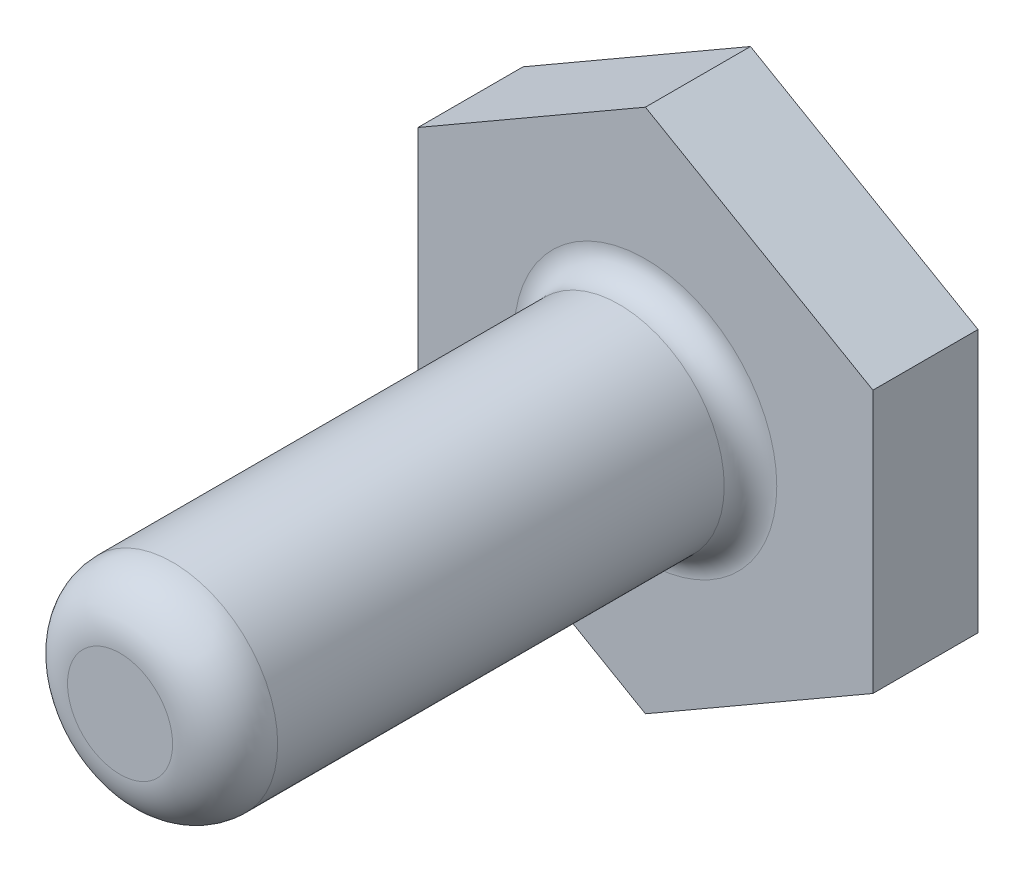
ISO-10303-21;
HEADER;
FILE_DESCRIPTION(('STEP AP214'),'2;1');
FILE_NAME('part.step','',(''),(''),'','','');
FILE_SCHEMA(('AUTOMOTIVE_DESIGN { 1 0 10303 214 1 1 1 1 }'));
ENDSEC;
DATA;
#1=APPLICATION_CONTEXT('core data for automotive mechanical design processes');
#2=APPLICATION_PROTOCOL_DEFINITION('international standard','automotive_design',2000,#1);
#3=PRODUCT_CONTEXT('',#1,'mechanical');
#4=PRODUCT('Part','Part','',(#3));
#5=PRODUCT_RELATED_PRODUCT_CATEGORY('part','',(#4));
#6=PRODUCT_DEFINITION_FORMATION('','',#4);
#7=PRODUCT_DEFINITION_CONTEXT('part definition',#1,'design');
#8=PRODUCT_DEFINITION('design','',#6,#7);
#9=PRODUCT_DEFINITION_SHAPE('','',#8);
#10=(LENGTH_UNIT() NAMED_UNIT(*) SI_UNIT(.MILLI.,.METRE.));
#11=(NAMED_UNIT(*) PLANE_ANGLE_UNIT() SI_UNIT($,.RADIAN.));
#12=(NAMED_UNIT(*) SI_UNIT($,.STERADIAN.) SOLID_ANGLE_UNIT());
#13=UNCERTAINTY_MEASURE_WITH_UNIT(LENGTH_MEASURE(1.E-05),#10,'distance_accuracy_value','');
#14=(GEOMETRIC_REPRESENTATION_CONTEXT(3) GLOBAL_UNCERTAINTY_ASSIGNED_CONTEXT((#13)) GLOBAL_UNIT_ASSIGNED_CONTEXT((#10,
#11,#12)) REPRESENTATION_CONTEXT('',''));
#15=CARTESIAN_POINT('',(0.,0.,0.));
#16=DIRECTION('',(0.,0.,1.));
#17=DIRECTION('',(1.,0.,0.));
#18=AXIS2_PLACEMENT_3D('',#15,#16,#17);
#19=CARTESIAN_POINT('',(-0.353108987948059,13.1896737599082,4.));
#20=DIRECTION('',(-0.499999999999999,-0.866025403784439,0.));
#21=DIRECTION('',(0.866025403784439,-0.5,0.));
#22=AXIS2_PLACEMENT_3D('',#19,#20,#21);
#23=PLANE('',#22);
#24=DIRECTION('',(-0.866025403784439,0.499999999999999,0.));
#25=VECTOR('',#24,1.);
#26=CARTESIAN_POINT('',(-0.353108987948059,13.1896737599082,0.));
#27=LINE('',#26,#25);
#28=CARTESIAN_POINT('',(-0.353108987948059,13.1896737599082,0.));
#29=VERTEX_POINT('',#28);
#30=CARTESIAN_POINT('',(-9.01336302579243,18.1896737599082,0.));
#31=VERTEX_POINT('',#30);
#32=EDGE_CURVE('E119',#29,#31,#27,.T.);
#33=ORIENTED_EDGE('',*,*,#32,.T.);
#34=DIRECTION('',(0.,0.,-1.));
#35=VECTOR('',#34,1.);
#36=CARTESIAN_POINT('',(-9.01336302579243,18.1896737599082,4.));
#37=LINE('',#36,#35);
#38=CARTESIAN_POINT('',(-9.01336302579243,18.1896737599082,4.));
#39=VERTEX_POINT('',#38);
#40=EDGE_CURVE('E136',#39,#31,#37,.T.);
#41=ORIENTED_EDGE('',*,*,#40,.F.);
#42=DIRECTION('',(-0.866025403784439,0.499999999999999,0.));
#43=VECTOR('',#42,1.);
#44=CARTESIAN_POINT('',(-0.353108987948059,13.1896737599082,4.));
#45=LINE('',#44,#43);
#46=CARTESIAN_POINT('',(-0.353108987948059,13.1896737599082,4.));
#47=VERTEX_POINT('',#46);
#48=EDGE_CURVE('E129',#47,#39,#45,.T.);
#49=ORIENTED_EDGE('',*,*,#48,.F.);
#50=DIRECTION('',(0.,0.,-1.));
#51=VECTOR('',#50,1.);
#52=CARTESIAN_POINT('',(-0.353108987948059,13.1896737599082,4.));
#53=LINE('',#52,#51);
#54=EDGE_CURVE('E115',#47,#29,#53,.T.);
#55=ORIENTED_EDGE('',*,*,#54,.T.);
#56=EDGE_LOOP('',(#33,#41,#49,#55));
#57=FACE_BOUND('',#56,.T.);
#58=ADVANCED_FACE('F33',(#57),#23,.F.);
#59=CARTESIAN_POINT('',(-9.01336302579243,18.1896737599082,4.));
#60=DIRECTION('',(0.5,-0.866025403784439,0.));
#61=DIRECTION('',(0.866025403784439,0.5,0.));
#62=AXIS2_PLACEMENT_3D('',#59,#60,#61);
#63=PLANE('',#62);
#64=DIRECTION('',(-0.866025403784439,-0.5,0.));
#65=VECTOR('',#64,1.);
#66=CARTESIAN_POINT('',(-9.01336302579243,18.1896737599082,0.));
#67=LINE('',#66,#65);
#68=CARTESIAN_POINT('',(-17.6736170636368,13.1896737599082,0.));
#69=VERTEX_POINT('',#68);
#70=EDGE_CURVE('E122',#31,#69,#67,.T.);
#71=ORIENTED_EDGE('',*,*,#70,.T.);
#72=DIRECTION('',(0.,0.,-1.));
#73=VECTOR('',#72,1.);
#74=CARTESIAN_POINT('',(-17.6736170636368,13.1896737599082,4.));
#75=LINE('',#74,#73);
#76=CARTESIAN_POINT('',(-17.6736170636368,13.1896737599082,4.));
#77=VERTEX_POINT('',#76);
#78=EDGE_CURVE('E133',#77,#69,#75,.T.);
#79=ORIENTED_EDGE('',*,*,#78,.F.);
#80=DIRECTION('',(-0.866025403784439,-0.5,0.));
#81=VECTOR('',#80,1.);
#82=CARTESIAN_POINT('',(-9.01336302579243,18.1896737599082,4.));
#83=LINE('',#82,#81);
#84=EDGE_CURVE('E88',#39,#77,#83,.T.);
#85=ORIENTED_EDGE('',*,*,#84,.F.);
#86=ORIENTED_EDGE('',*,*,#40,.T.);
#87=EDGE_LOOP('',(#71,#79,#85,#86));
#88=FACE_BOUND('',#87,.T.);
#89=ADVANCED_FACE('F159',(#88),#63,.F.);
#90=CARTESIAN_POINT('',(-17.6736170636368,13.1896737599082,4.));
#91=DIRECTION('',(1.,0.,0.));
#92=DIRECTION('',(0.,0.,-1.));
#93=AXIS2_PLACEMENT_3D('',#90,#91,#92);
#94=PLANE('',#93);
#95=DIRECTION('',(0.,-1.,0.));
#96=VECTOR('',#95,1.);
#97=CARTESIAN_POINT('',(-17.6736170636368,13.1896737599082,0.));
#98=LINE('',#97,#96);
#99=CARTESIAN_POINT('',(-17.6736170636368,3.18967375990823,0.));
#100=VERTEX_POINT('',#99);
#101=EDGE_CURVE('E124',#69,#100,#98,.T.);
#102=ORIENTED_EDGE('',*,*,#101,.T.);
#103=DIRECTION('',(0.,0.,-1.));
#104=VECTOR('',#103,1.);
#105=CARTESIAN_POINT('',(-17.6736170636368,3.18967375990823,4.));
#106=LINE('',#105,#104);
#107=CARTESIAN_POINT('',(-17.6736170636368,3.18967375990823,4.));
#108=VERTEX_POINT('',#107);
#109=EDGE_CURVE('E110',#108,#100,#106,.T.);
#110=ORIENTED_EDGE('',*,*,#109,.F.);
#111=DIRECTION('',(0.,-1.,0.));
#112=VECTOR('',#111,1.);
#113=CARTESIAN_POINT('',(-17.6736170636368,13.1896737599082,4.));
#114=LINE('',#113,#112);
#115=EDGE_CURVE('E101',#77,#108,#114,.T.);
#116=ORIENTED_EDGE('',*,*,#115,.F.);
#117=ORIENTED_EDGE('',*,*,#78,.T.);
#118=EDGE_LOOP('',(#102,#110,#116,#117));
#119=FACE_BOUND('',#118,.T.);
#120=ADVANCED_FACE('F165',(#119),#94,.F.);
#121=CARTESIAN_POINT('',(-17.6736170636368,3.18967375990823,4.));
#122=DIRECTION('',(0.5,0.866025403784439,0.));
#123=DIRECTION('',(-0.866025403784439,0.5,0.));
#124=AXIS2_PLACEMENT_3D('',#121,#122,#123);
#125=PLANE('',#124);
#126=DIRECTION('',(0.866025403784439,-0.5,0.));
#127=VECTOR('',#126,1.);
#128=CARTESIAN_POINT('',(-17.6736170636368,3.18967375990823,0.));
#129=LINE('',#128,#127);
#130=CARTESIAN_POINT('',(-9.01336302579243,-1.81032624009177,0.));
#131=VERTEX_POINT('',#130);
#132=EDGE_CURVE('E109',#100,#131,#129,.T.);
#133=ORIENTED_EDGE('',*,*,#132,.T.);
#134=DIRECTION('',(0.,0.,-1.));
#135=VECTOR('',#134,1.);
#136=CARTESIAN_POINT('',(-9.01336302579243,-1.81032624009177,4.));
#137=LINE('',#136,#135);
#138=CARTESIAN_POINT('',(-9.01336302579243,-1.81032624009177,4.));
#139=VERTEX_POINT('',#138);
#140=EDGE_CURVE('E106',#139,#131,#137,.T.);
#141=ORIENTED_EDGE('',*,*,#140,.F.);
#142=DIRECTION('',(0.866025403784439,-0.5,0.));
#143=VECTOR('',#142,1.);
#144=CARTESIAN_POINT('',(-17.6736170636368,3.18967375990823,4.));
#145=LINE('',#144,#143);
#146=EDGE_CURVE('E95',#108,#139,#145,.T.);
#147=ORIENTED_EDGE('',*,*,#146,.F.);
#148=ORIENTED_EDGE('',*,*,#109,.T.);
#149=EDGE_LOOP('',(#133,#141,#147,#148));
#150=FACE_BOUND('',#149,.T.);
#151=ADVANCED_FACE('F107',(#150),#125,.F.);
#152=CARTESIAN_POINT('',(-9.01336302579243,-1.81032624009177,4.));
#153=DIRECTION('',(-0.5,0.866025403784439,0.));
#154=DIRECTION('',(-0.866025403784439,-0.5,0.));
#155=AXIS2_PLACEMENT_3D('',#152,#153,#154);
#156=PLANE('',#155);
#157=DIRECTION('',(0.866025403784438,0.5,0.));
#158=VECTOR('',#157,1.);
#159=CARTESIAN_POINT('',(-9.01336302579243,-1.81032624009177,0.));
#160=LINE('',#159,#158);
#161=CARTESIAN_POINT('',(-0.353108987948059,3.18967375990823,0.));
#162=VERTEX_POINT('',#161);
#163=EDGE_CURVE('E73',#131,#162,#160,.T.);
#164=ORIENTED_EDGE('',*,*,#163,.T.);
#165=DIRECTION('',(0.,0.,-1.));
#166=VECTOR('',#165,1.);
#167=CARTESIAN_POINT('',(-0.353108987948059,3.18967375990823,4.));
#168=LINE('',#167,#166);
#169=CARTESIAN_POINT('',(-0.353108987948059,3.18967375990823,4.));
#170=VERTEX_POINT('',#169);
#171=EDGE_CURVE('E111',#170,#162,#168,.T.);
#172=ORIENTED_EDGE('',*,*,#171,.F.);
#173=DIRECTION('',(0.866025403784438,0.5,0.));
#174=VECTOR('',#173,1.);
#175=CARTESIAN_POINT('',(-9.01336302579243,-1.81032624009177,4.));
#176=LINE('',#175,#174);
#177=EDGE_CURVE('E99',#139,#170,#176,.T.);
#178=ORIENTED_EDGE('',*,*,#177,.F.);
#179=ORIENTED_EDGE('',*,*,#140,.T.);
#180=EDGE_LOOP('',(#164,#172,#178,#179));
#181=FACE_BOUND('',#180,.T.);
#182=ADVANCED_FACE('F113',(#181),#156,.F.);
#183=CARTESIAN_POINT('',(-0.353108987948059,3.18967375990823,4.));
#184=DIRECTION('',(-1.,0.,0.));
#185=DIRECTION('',(0.,-1.,0.));
#186=AXIS2_PLACEMENT_3D('',#183,#184,#185);
#187=PLANE('',#186);
#188=DIRECTION('',(0.,1.,0.));
#189=VECTOR('',#188,1.);
#190=CARTESIAN_POINT('',(-0.353108987948059,3.18967375990823,0.));
#191=LINE('',#190,#189);
#192=EDGE_CURVE('E79',#162,#29,#191,.T.);
#193=ORIENTED_EDGE('',*,*,#192,.T.);
#194=ORIENTED_EDGE('',*,*,#54,.F.);
#195=DIRECTION('',(0.,1.,0.));
#196=VECTOR('',#195,1.);
#197=CARTESIAN_POINT('',(-0.353108987948059,3.18967375990823,4.));
#198=LINE('',#197,#196);
#199=EDGE_CURVE('E50',#170,#47,#198,.T.);
#200=ORIENTED_EDGE('',*,*,#199,.F.);
#201=ORIENTED_EDGE('',*,*,#171,.T.);
#202=EDGE_LOOP('',(#193,#194,#200,#201));
#203=FACE_BOUND('',#202,.T.);
#204=ADVANCED_FACE('F175',(#203),#187,.F.);
#205=CARTESIAN_POINT('',(0.,0.,4.));
#206=DIRECTION('',(0.,0.,1.));
#207=DIRECTION('',(1.,0.,0.));
#208=AXIS2_PLACEMENT_3D('',#205,#206,#207);
#209=PLANE('',#208);
#210=CARTESIAN_POINT('',(-9.01336302579244,8.18967375990822,4.));
#211=DIRECTION('',(0.,0.,1.));
#212=DIRECTION('',(1.,0.,0.));
#213=AXIS2_PLACEMENT_3D('',#210,#211,#212);
#214=CIRCLE('',#213,5.);
#215=CARTESIAN_POINT('',(-4.01336302579243,8.18967375990822,4.));
#216=VERTEX_POINT('',#215);
#217=EDGE_CURVE('E11',#216,#216,#214,.F.);
#218=ORIENTED_EDGE('',*,*,#217,.T.);
#219=EDGE_LOOP('',(#218));
#220=FACE_BOUND('',#219,.T.);
#221=ORIENTED_EDGE('',*,*,#48,.T.);
#222=ORIENTED_EDGE('',*,*,#84,.T.);
#223=ORIENTED_EDGE('',*,*,#115,.T.);
#224=ORIENTED_EDGE('',*,*,#146,.T.);
#225=ORIENTED_EDGE('',*,*,#177,.T.);
#226=ORIENTED_EDGE('',*,*,#199,.T.);
#227=EDGE_LOOP('',(#221,#222,#223,#224,#225,#226));
#228=FACE_BOUND('',#227,.T.);
#229=ADVANCED_FACE('F97',(#220,#228),#209,.T.);
#230=CARTESIAN_POINT('',(0.,0.,0.));
#231=DIRECTION('',(0.,0.,1.));
#232=DIRECTION('',(1.,0.,0.));
#233=AXIS2_PLACEMENT_3D('',#230,#231,#232);
#234=PLANE('',#233);
#235=ORIENTED_EDGE('',*,*,#32,.F.);
#236=ORIENTED_EDGE('',*,*,#192,.F.);
#237=ORIENTED_EDGE('',*,*,#163,.F.);
#238=ORIENTED_EDGE('',*,*,#132,.F.);
#239=ORIENTED_EDGE('',*,*,#101,.F.);
#240=ORIENTED_EDGE('',*,*,#70,.F.);
#241=EDGE_LOOP('',(#235,#236,#237,#238,#239,#240));
#242=FACE_BOUND('',#241,.T.);
#243=ADVANCED_FACE('F178',(#242),#234,.F.);
#244=CARTESIAN_POINT('',(-9.01336302579244,8.18967375990822,24.));
#245=DIRECTION('',(0.,0.,-1.));
#246=DIRECTION('',(-1.,0.,0.));
#247=AXIS2_PLACEMENT_3D('',#244,#245,#246);
#248=CYLINDRICAL_SURFACE('',#247,4.);
#249=CARTESIAN_POINT('',(-9.01336302579244,8.18967375990822,5.));
#250=DIRECTION('',(0.,0.,1.));
#251=DIRECTION('',(1.,0.,0.));
#252=AXIS2_PLACEMENT_3D('',#249,#250,#251);
#253=CIRCLE('',#252,4.);
#254=CARTESIAN_POINT('',(-5.01336302579243,8.18967375990822,5.));
#255=VERTEX_POINT('',#254);
#256=EDGE_CURVE('E42',#255,#255,#253,.T.);
#257=ORIENTED_EDGE('',*,*,#256,.T.);
#258=EDGE_LOOP('',(#257));
#259=FACE_BOUND('',#258,.T.);
#260=CARTESIAN_POINT('',(-9.01336302579244,8.18967375990822,22.));
#261=DIRECTION('',(0.,0.,1.));
#262=DIRECTION('',(1.,0.,0.));
#263=AXIS2_PLACEMENT_3D('',#260,#261,#262);
#264=CIRCLE('',#263,4.);
#265=CARTESIAN_POINT('',(-5.01336302579243,8.18967375990822,22.));
#266=VERTEX_POINT('',#265);
#267=EDGE_CURVE('E141',#266,#266,#264,.F.);
#268=ORIENTED_EDGE('',*,*,#267,.T.);
#269=EDGE_LOOP('',(#268));
#270=FACE_BOUND('',#269,.T.);
#271=ADVANCED_FACE('F146',(#259,#270),#248,.T.);
#272=CARTESIAN_POINT('',(-9.01336302579244,8.18967375990822,24.));
#273=DIRECTION('',(0.,0.,1.));
#274=DIRECTION('',(1.,0.,0.));
#275=AXIS2_PLACEMENT_3D('',#272,#273,#274);
#276=PLANE('',#275);
#277=CARTESIAN_POINT('',(-9.01336302579244,8.18967375990822,24.));
#278=DIRECTION('',(0.,0.,1.));
#279=DIRECTION('',(1.,0.,0.));
#280=AXIS2_PLACEMENT_3D('',#277,#278,#279);
#281=CIRCLE('',#280,2.);
#282=CARTESIAN_POINT('',(-7.01336302579243,8.18967375990822,24.));
#283=VERTEX_POINT('',#282);
#284=EDGE_CURVE('E138',#283,#283,#281,.T.);
#285=ORIENTED_EDGE('',*,*,#284,.T.);
#286=EDGE_LOOP('',(#285));
#287=FACE_BOUND('',#286,.T.);
#288=ADVANCED_FACE('F155',(#287),#276,.T.);
#289=CARTESIAN_POINT('',(-9.01336302579244,8.18967375990822,22.));
#290=DIRECTION('',(0.,0.,1.));
#291=DIRECTION('',(1.,0.,0.));
#292=AXIS2_PLACEMENT_3D('',#289,#290,#291);
#293=TOROIDAL_SURFACE('',#292,2.,2.);
#294=ORIENTED_EDGE('',*,*,#267,.F.);
#295=EDGE_LOOP('',(#294));
#296=FACE_BOUND('',#295,.T.);
#297=ORIENTED_EDGE('',*,*,#284,.F.);
#298=EDGE_LOOP('',(#297));
#299=FACE_BOUND('',#298,.T.);
#300=ADVANCED_FACE('F150',(#296,#299),#293,.T.);
#301=CARTESIAN_POINT('',(-9.01336302579244,8.18967375990822,5.));
#302=DIRECTION('',(0.,0.,1.));
#303=DIRECTION('',(1.,0.,0.));
#304=AXIS2_PLACEMENT_3D('',#301,#302,#303);
#305=TOROIDAL_SURFACE('',#304,5.,1.);
#306=ORIENTED_EDGE('',*,*,#217,.F.);
#307=EDGE_LOOP('',(#306));
#308=FACE_BOUND('',#307,.T.);
#309=ORIENTED_EDGE('',*,*,#256,.F.);
#310=EDGE_LOOP('',(#309));
#311=FACE_BOUND('',#310,.T.);
#312=ADVANCED_FACE('F35',(#308,#311),#305,.F.);
#313=CLOSED_SHELL('',(#58,#89,#120,#151,#182,#204,#229,#243,#271,#288,#300,#312));
#314=MANIFOLD_SOLID_BREP('B2',#313);
#315=ADVANCED_BREP_SHAPE_REPRESENTATION('',(#18,#314),#14);
#316=SHAPE_DEFINITION_REPRESENTATION(#9,#315);
ENDSEC;
END-ISO-10303-21;
